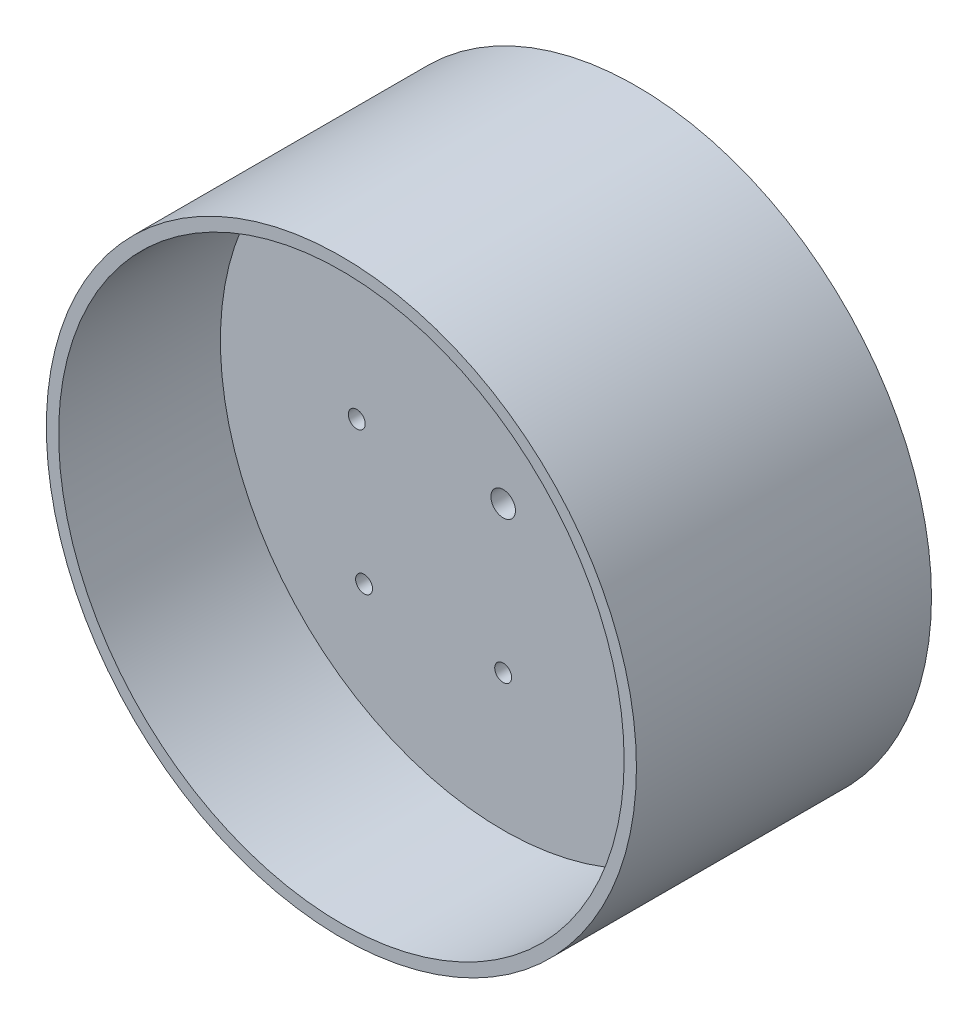
ISO-10303-21;
HEADER;
FILE_DESCRIPTION(('STEP AP214'),'2;1');
FILE_NAME('part.step','',(''),(''),'','','');
FILE_SCHEMA(('AUTOMOTIVE_DESIGN { 1 0 10303 214 1 1 1 1 }'));
ENDSEC;
DATA;
#1=APPLICATION_CONTEXT('core data for automotive mechanical design processes');
#2=APPLICATION_PROTOCOL_DEFINITION('international standard','automotive_design',2000,#1);
#3=PRODUCT_CONTEXT('',#1,'mechanical');
#4=PRODUCT('Part','Part','',(#3));
#5=PRODUCT_RELATED_PRODUCT_CATEGORY('part','',(#4));
#6=PRODUCT_DEFINITION_FORMATION('','',#4);
#7=PRODUCT_DEFINITION_CONTEXT('part definition',#1,'design');
#8=PRODUCT_DEFINITION('design','',#6,#7);
#9=PRODUCT_DEFINITION_SHAPE('','',#8);
#10=(LENGTH_UNIT() NAMED_UNIT(*) SI_UNIT(.MILLI.,.METRE.));
#11=(NAMED_UNIT(*) PLANE_ANGLE_UNIT() SI_UNIT($,.RADIAN.));
#12=(NAMED_UNIT(*) SI_UNIT($,.STERADIAN.) SOLID_ANGLE_UNIT());
#13=UNCERTAINTY_MEASURE_WITH_UNIT(LENGTH_MEASURE(1.E-05),#10,'distance_accuracy_value','');
#14=(GEOMETRIC_REPRESENTATION_CONTEXT(3) GLOBAL_UNCERTAINTY_ASSIGNED_CONTEXT((#13)) GLOBAL_UNIT_ASSIGNED_CONTEXT((#10,
#11,#12)) REPRESENTATION_CONTEXT('',''));
#15=CARTESIAN_POINT('',(0.,0.,0.));
#16=DIRECTION('',(0.,0.,1.));
#17=DIRECTION('',(1.,0.,0.));
#18=AXIS2_PLACEMENT_3D('',#15,#16,#17);
#19=CARTESIAN_POINT('',(0.,0.,76.2));
#20=DIRECTION('',(0.,0.,1.));
#21=DIRECTION('',(1.,0.,0.));
#22=AXIS2_PLACEMENT_3D('',#19,#20,#21);
#23=PLANE('',#22);
#24=CARTESIAN_POINT('',(0.,0.,76.2));
#25=DIRECTION('',(0.,0.,1.));
#26=DIRECTION('',(1.,0.,0.));
#27=AXIS2_PLACEMENT_3D('',#24,#25,#26);
#28=CIRCLE('',#27,76.2);
#29=CARTESIAN_POINT('',(76.2,0.,76.2));
#30=VERTEX_POINT('',#29);
#31=EDGE_CURVE('E51',#30,#30,#28,.T.);
#32=ORIENTED_EDGE('',*,*,#31,.T.);
#33=EDGE_LOOP('',(#32));
#34=FACE_BOUND('',#33,.T.);
#35=CARTESIAN_POINT('',(0.,0.,76.2));
#36=DIRECTION('',(0.,0.,1.));
#37=DIRECTION('',(1.,0.,0.));
#38=AXIS2_PLACEMENT_3D('',#35,#36,#37);
#39=CIRCLE('',#38,73.025);
#40=CARTESIAN_POINT('',(73.025,0.,76.2));
#41=VERTEX_POINT('',#40);
#42=EDGE_CURVE('E66',#41,#41,#39,.T.);
#43=ORIENTED_EDGE('',*,*,#42,.F.);
#44=EDGE_LOOP('',(#43));
#45=FACE_BOUND('',#44,.T.);
#46=ADVANCED_FACE('F43',(#34,#45),#23,.T.);
#47=CARTESIAN_POINT('',(0.,0.,0.));
#48=DIRECTION('',(0.,0.,1.));
#49=DIRECTION('',(1.,0.,0.));
#50=AXIS2_PLACEMENT_3D('',#47,#48,#49);
#51=PLANE('',#50);
#52=CARTESIAN_POINT('',(0.,0.,0.));
#53=DIRECTION('',(0.,0.,1.));
#54=DIRECTION('',(1.,0.,0.));
#55=AXIS2_PLACEMENT_3D('',#52,#53,#54);
#56=CIRCLE('',#55,3.175);
#57=CARTESIAN_POINT('',(3.175,0.,0.));
#58=VERTEX_POINT('',#57);
#59=EDGE_CURVE('E117',#58,#58,#56,.T.);
#60=ORIENTED_EDGE('',*,*,#59,.T.);
#61=EDGE_LOOP('',(#60));
#62=FACE_BOUND('',#61,.T.);
#63=CARTESIAN_POINT('',(35.9210244842765,35.9210244842768,0.));
#64=DIRECTION('',(0.,0.,1.));
#65=DIRECTION('',(1.,0.,0.));
#66=AXIS2_PLACEMENT_3D('',#63,#64,#65);
#67=CIRCLE('',#66,2.1828125);
#68=CARTESIAN_POINT('',(38.1038369842765,35.9210244842768,0.));
#69=VERTEX_POINT('',#68);
#70=EDGE_CURVE('E112',#69,#69,#67,.T.);
#71=ORIENTED_EDGE('',*,*,#70,.T.);
#72=EDGE_LOOP('',(#71));
#73=FACE_BOUND('',#72,.T.);
#74=CARTESIAN_POINT('',(35.9210244842767,-35.9210244842765,0.));
#75=DIRECTION('',(0.,0.,1.));
#76=DIRECTION('',(1.,0.,0.));
#77=AXIS2_PLACEMENT_3D('',#74,#75,#76);
#78=CIRCLE('',#77,2.18281250000001);
#79=CARTESIAN_POINT('',(38.1038369842767,-35.9210244842765,0.));
#80=VERTEX_POINT('',#79);
#81=EDGE_CURVE('E121',#80,#80,#78,.T.);
#82=ORIENTED_EDGE('',*,*,#81,.T.);
#83=EDGE_LOOP('',(#82));
#84=FACE_BOUND('',#83,.T.);
#85=CARTESIAN_POINT('',(-35.9210244842765,-35.9210244842768,0.));
#86=DIRECTION('',(0.,0.,1.));
#87=DIRECTION('',(1.,0.,0.));
#88=AXIS2_PLACEMENT_3D('',#85,#86,#87);
#89=CIRCLE('',#88,2.18281250000001);
#90=CARTESIAN_POINT('',(-33.7382119842765,-35.9210244842768,0.));
#91=VERTEX_POINT('',#90);
#92=EDGE_CURVE('E129',#91,#91,#89,.T.);
#93=ORIENTED_EDGE('',*,*,#92,.T.);
#94=EDGE_LOOP('',(#93));
#95=FACE_BOUND('',#94,.T.);
#96=CARTESIAN_POINT('',(-35.9210244842768,35.9210244842765,0.));
#97=DIRECTION('',(0.,0.,1.));
#98=DIRECTION('',(1.,0.,0.));
#99=AXIS2_PLACEMENT_3D('',#96,#97,#98);
#100=CIRCLE('',#99,2.18281250000001);
#101=CARTESIAN_POINT('',(-33.7382119842768,35.9210244842765,0.));
#102=VERTEX_POINT('',#101);
#103=EDGE_CURVE('E77',#102,#102,#100,.T.);
#104=ORIENTED_EDGE('',*,*,#103,.T.);
#105=EDGE_LOOP('',(#104));
#106=FACE_BOUND('',#105,.T.);
#107=CARTESIAN_POINT('',(37.81298,0.,0.));
#108=DIRECTION('',(0.,0.,1.));
#109=DIRECTION('',(1.,0.,0.));
#110=AXIS2_PLACEMENT_3D('',#107,#108,#109);
#111=CIRCLE('',#110,2.1828125);
#112=CARTESIAN_POINT('',(39.9957925,0.,0.));
#113=VERTEX_POINT('',#112);
#114=EDGE_CURVE('E71',#113,#113,#111,.T.);
#115=ORIENTED_EDGE('',*,*,#114,.T.);
#116=EDGE_LOOP('',(#115));
#117=FACE_BOUND('',#116,.T.);
#118=CARTESIAN_POINT('',(0.,37.81298,0.));
#119=DIRECTION('',(0.,0.,1.));
#120=DIRECTION('',(1.,0.,0.));
#121=AXIS2_PLACEMENT_3D('',#118,#119,#120);
#122=CIRCLE('',#121,2.1828125);
#123=CARTESIAN_POINT('',(2.1828125,37.81298,0.));
#124=VERTEX_POINT('',#123);
#125=EDGE_CURVE('E89',#124,#124,#122,.T.);
#126=ORIENTED_EDGE('',*,*,#125,.T.);
#127=EDGE_LOOP('',(#126));
#128=FACE_BOUND('',#127,.T.);
#129=CARTESIAN_POINT('',(-37.81298,0.,0.));
#130=DIRECTION('',(0.,0.,1.));
#131=DIRECTION('',(1.,0.,0.));
#132=AXIS2_PLACEMENT_3D('',#129,#130,#131);
#133=CIRCLE('',#132,2.1828125);
#134=CARTESIAN_POINT('',(-35.6301675,0.,0.));
#135=VERTEX_POINT('',#134);
#136=EDGE_CURVE('E81',#135,#135,#133,.T.);
#137=ORIENTED_EDGE('',*,*,#136,.T.);
#138=EDGE_LOOP('',(#137));
#139=FACE_BOUND('',#138,.T.);
#140=CARTESIAN_POINT('',(0.,-37.81298,0.));
#141=DIRECTION('',(0.,0.,1.));
#142=DIRECTION('',(1.,0.,0.));
#143=AXIS2_PLACEMENT_3D('',#140,#141,#142);
#144=CIRCLE('',#143,2.1828125);
#145=CARTESIAN_POINT('',(2.1828125,-37.81298,0.));
#146=VERTEX_POINT('',#145);
#147=EDGE_CURVE('E72',#146,#146,#144,.T.);
#148=ORIENTED_EDGE('',*,*,#147,.T.);
#149=EDGE_LOOP('',(#148));
#150=FACE_BOUND('',#149,.T.);
#151=CARTESIAN_POINT('',(0.,0.,0.));
#152=DIRECTION('',(0.,0.,1.));
#153=DIRECTION('',(1.,0.,0.));
#154=AXIS2_PLACEMENT_3D('',#151,#152,#153);
#155=CIRCLE('',#154,76.2);
#156=CARTESIAN_POINT('',(76.2,0.,0.));
#157=VERTEX_POINT('',#156);
#158=EDGE_CURVE('E58',#157,#157,#155,.T.);
#159=ORIENTED_EDGE('',*,*,#158,.F.);
#160=EDGE_LOOP('',(#159));
#161=FACE_BOUND('',#160,.T.);
#162=ADVANCED_FACE('F146',(#62,#73,#84,#95,#106,#117,#128,#139,#150,#161),#51,.F.);
#163=CARTESIAN_POINT('',(0.,0.,76.2));
#164=DIRECTION('',(0.,0.,-1.));
#165=DIRECTION('',(-1.,0.,0.));
#166=AXIS2_PLACEMENT_3D('',#163,#164,#165);
#167=CYLINDRICAL_SURFACE('',#166,76.2);
#168=ORIENTED_EDGE('',*,*,#31,.F.);
#169=EDGE_LOOP('',(#168));
#170=FACE_BOUND('',#169,.T.);
#171=ORIENTED_EDGE('',*,*,#158,.T.);
#172=EDGE_LOOP('',(#171));
#173=FACE_BOUND('',#172,.T.);
#174=ADVANCED_FACE('F45',(#170,#173),#167,.T.);
#175=CARTESIAN_POINT('',(0.,0.,76.2));
#176=DIRECTION('',(0.,0.,-1.));
#177=DIRECTION('',(-1.,0.,0.));
#178=AXIS2_PLACEMENT_3D('',#175,#176,#177);
#179=CYLINDRICAL_SURFACE('',#178,73.025);
#180=CARTESIAN_POINT('',(0.,0.,34.417));
#181=DIRECTION('',(0.,0.,1.));
#182=DIRECTION('',(1.,0.,0.));
#183=AXIS2_PLACEMENT_3D('',#180,#181,#182);
#184=CIRCLE('',#183,73.025);
#185=CARTESIAN_POINT('',(73.025,0.,34.417));
#186=VERTEX_POINT('',#185);
#187=EDGE_CURVE('E10',#186,#186,#184,.T.);
#188=ORIENTED_EDGE('',*,*,#187,.F.);
#189=EDGE_LOOP('',(#188));
#190=FACE_BOUND('',#189,.T.);
#191=ORIENTED_EDGE('',*,*,#42,.T.);
#192=EDGE_LOOP('',(#191));
#193=FACE_BOUND('',#192,.T.);
#194=ADVANCED_FACE('F160',(#190,#193),#179,.F.);
#195=CARTESIAN_POINT('',(0.,0.,34.417));
#196=DIRECTION('',(0.,0.,1.));
#197=DIRECTION('',(1.,0.,0.));
#198=AXIS2_PLACEMENT_3D('',#195,#196,#197);
#199=PLANE('',#198);
#200=CARTESIAN_POINT('',(0.,0.,34.417));
#201=DIRECTION('',(0.,0.,1.));
#202=DIRECTION('',(1.,0.,0.));
#203=AXIS2_PLACEMENT_3D('',#200,#201,#202);
#204=CIRCLE('',#203,3.175);
#205=CARTESIAN_POINT('',(3.175,0.,34.417));
#206=VERTEX_POINT('',#205);
#207=EDGE_CURVE('E136',#206,#206,#204,.T.);
#208=ORIENTED_EDGE('',*,*,#207,.F.);
#209=EDGE_LOOP('',(#208));
#210=FACE_BOUND('',#209,.T.);
#211=CARTESIAN_POINT('',(35.9210244842765,35.9210244842768,34.417));
#212=DIRECTION('',(0.,0.,1.));
#213=DIRECTION('',(1.,0.,0.));
#214=AXIS2_PLACEMENT_3D('',#211,#212,#213);
#215=CIRCLE('',#214,2.1828125);
#216=CARTESIAN_POINT('',(38.1038369842765,35.9210244842768,34.417));
#217=VERTEX_POINT('',#216);
#218=EDGE_CURVE('E116',#217,#217,#215,.T.);
#219=ORIENTED_EDGE('',*,*,#218,.F.);
#220=EDGE_LOOP('',(#219));
#221=FACE_BOUND('',#220,.T.);
#222=CARTESIAN_POINT('',(35.9210244842767,-35.9210244842765,34.417));
#223=DIRECTION('',(0.,0.,1.));
#224=DIRECTION('',(1.,0.,0.));
#225=AXIS2_PLACEMENT_3D('',#222,#223,#224);
#226=CIRCLE('',#225,2.18281250000001);
#227=CARTESIAN_POINT('',(38.1038369842767,-35.9210244842765,34.417));
#228=VERTEX_POINT('',#227);
#229=EDGE_CURVE('E125',#228,#228,#226,.T.);
#230=ORIENTED_EDGE('',*,*,#229,.F.);
#231=EDGE_LOOP('',(#230));
#232=FACE_BOUND('',#231,.T.);
#233=CARTESIAN_POINT('',(-35.9210244842765,-35.9210244842768,34.417));
#234=DIRECTION('',(0.,0.,1.));
#235=DIRECTION('',(1.,0.,0.));
#236=AXIS2_PLACEMENT_3D('',#233,#234,#235);
#237=CIRCLE('',#236,2.18281250000001);
#238=CARTESIAN_POINT('',(-33.7382119842765,-35.9210244842768,34.417));
#239=VERTEX_POINT('',#238);
#240=EDGE_CURVE('E108',#239,#239,#237,.T.);
#241=ORIENTED_EDGE('',*,*,#240,.F.);
#242=EDGE_LOOP('',(#241));
#243=FACE_BOUND('',#242,.T.);
#244=CARTESIAN_POINT('',(-35.9210244842768,35.9210244842765,34.417));
#245=DIRECTION('',(0.,0.,1.));
#246=DIRECTION('',(1.,0.,0.));
#247=AXIS2_PLACEMENT_3D('',#244,#245,#246);
#248=CIRCLE('',#247,2.18281250000001);
#249=CARTESIAN_POINT('',(-33.7382119842768,35.9210244842765,34.417));
#250=VERTEX_POINT('',#249);
#251=EDGE_CURVE('E104',#250,#250,#248,.T.);
#252=ORIENTED_EDGE('',*,*,#251,.F.);
#253=EDGE_LOOP('',(#252));
#254=FACE_BOUND('',#253,.T.);
#255=CARTESIAN_POINT('',(37.81298,0.,34.417));
#256=DIRECTION('',(0.,0.,1.));
#257=DIRECTION('',(1.,0.,0.));
#258=AXIS2_PLACEMENT_3D('',#255,#256,#257);
#259=CIRCLE('',#258,2.1828125);
#260=CARTESIAN_POINT('',(39.9957925,0.,34.417));
#261=VERTEX_POINT('',#260);
#262=EDGE_CURVE('E97',#261,#261,#259,.T.);
#263=ORIENTED_EDGE('',*,*,#262,.F.);
#264=EDGE_LOOP('',(#263));
#265=FACE_BOUND('',#264,.T.);
#266=CARTESIAN_POINT('',(0.,37.81298,34.417));
#267=DIRECTION('',(0.,0.,1.));
#268=DIRECTION('',(1.,0.,0.));
#269=AXIS2_PLACEMENT_3D('',#266,#267,#268);
#270=CIRCLE('',#269,2.1828125);
#271=CARTESIAN_POINT('',(2.1828125,37.81298,34.417));
#272=VERTEX_POINT('',#271);
#273=EDGE_CURVE('E93',#272,#272,#270,.T.);
#274=ORIENTED_EDGE('',*,*,#273,.F.);
#275=EDGE_LOOP('',(#274));
#276=FACE_BOUND('',#275,.T.);
#277=CARTESIAN_POINT('',(-37.81298,0.,34.417));
#278=DIRECTION('',(0.,0.,1.));
#279=DIRECTION('',(1.,0.,0.));
#280=AXIS2_PLACEMENT_3D('',#277,#278,#279);
#281=CIRCLE('',#280,2.1828125);
#282=CARTESIAN_POINT('',(-35.6301675,0.,34.417));
#283=VERTEX_POINT('',#282);
#284=EDGE_CURVE('E85',#283,#283,#281,.T.);
#285=ORIENTED_EDGE('',*,*,#284,.F.);
#286=EDGE_LOOP('',(#285));
#287=FACE_BOUND('',#286,.T.);
#288=CARTESIAN_POINT('',(0.,-37.81298,34.417));
#289=DIRECTION('',(0.,0.,1.));
#290=DIRECTION('',(1.,0.,0.));
#291=AXIS2_PLACEMENT_3D('',#288,#289,#290);
#292=CIRCLE('',#291,2.1828125);
#293=CARTESIAN_POINT('',(2.1828125,-37.81298,34.417));
#294=VERTEX_POINT('',#293);
#295=EDGE_CURVE('E76',#294,#294,#292,.T.);
#296=ORIENTED_EDGE('',*,*,#295,.F.);
#297=EDGE_LOOP('',(#296));
#298=FACE_BOUND('',#297,.T.);
#299=ORIENTED_EDGE('',*,*,#187,.T.);
#300=EDGE_LOOP('',(#299));
#301=FACE_BOUND('',#300,.T.);
#302=ADVANCED_FACE('F156',(#210,#221,#232,#243,#254,#265,#276,#287,#298,#301),#199,.T.);
#303=CARTESIAN_POINT('',(0.,-37.81298,0.));
#304=DIRECTION('',(0.,0.,1.));
#305=DIRECTION('',(1.,0.,0.));
#306=AXIS2_PLACEMENT_3D('',#303,#304,#305);
#307=CYLINDRICAL_SURFACE('',#306,2.1828125);
#308=ORIENTED_EDGE('',*,*,#147,.F.);
#309=EDGE_LOOP('',(#308));
#310=FACE_BOUND('',#309,.T.);
#311=ORIENTED_EDGE('',*,*,#295,.T.);
#312=EDGE_LOOP('',(#311));
#313=FACE_BOUND('',#312,.T.);
#314=ADVANCED_FACE('F159',(#310,#313),#307,.F.);
#315=CARTESIAN_POINT('',(-37.81298,0.,0.));
#316=DIRECTION('',(0.,0.,1.));
#317=DIRECTION('',(1.,0.,0.));
#318=AXIS2_PLACEMENT_3D('',#315,#316,#317);
#319=CYLINDRICAL_SURFACE('',#318,2.1828125);
#320=ORIENTED_EDGE('',*,*,#136,.F.);
#321=EDGE_LOOP('',(#320));
#322=FACE_BOUND('',#321,.T.);
#323=ORIENTED_EDGE('',*,*,#284,.T.);
#324=EDGE_LOOP('',(#323));
#325=FACE_BOUND('',#324,.T.);
#326=ADVANCED_FACE('F179',(#322,#325),#319,.F.);
#327=CARTESIAN_POINT('',(0.,37.81298,0.));
#328=DIRECTION('',(0.,0.,1.));
#329=DIRECTION('',(1.,0.,0.));
#330=AXIS2_PLACEMENT_3D('',#327,#328,#329);
#331=CYLINDRICAL_SURFACE('',#330,2.1828125);
#332=ORIENTED_EDGE('',*,*,#125,.F.);
#333=EDGE_LOOP('',(#332));
#334=FACE_BOUND('',#333,.T.);
#335=ORIENTED_EDGE('',*,*,#273,.T.);
#336=EDGE_LOOP('',(#335));
#337=FACE_BOUND('',#336,.T.);
#338=ADVANCED_FACE('F185',(#334,#337),#331,.F.);
#339=CARTESIAN_POINT('',(37.81298,0.,0.));
#340=DIRECTION('',(0.,0.,1.));
#341=DIRECTION('',(1.,0.,0.));
#342=AXIS2_PLACEMENT_3D('',#339,#340,#341);
#343=CYLINDRICAL_SURFACE('',#342,2.1828125);
#344=ORIENTED_EDGE('',*,*,#114,.F.);
#345=EDGE_LOOP('',(#344));
#346=FACE_BOUND('',#345,.T.);
#347=ORIENTED_EDGE('',*,*,#262,.T.);
#348=EDGE_LOOP('',(#347));
#349=FACE_BOUND('',#348,.T.);
#350=ADVANCED_FACE('F262',(#346,#349),#343,.F.);
#351=CARTESIAN_POINT('',(-35.9210244842768,35.9210244842765,0.));
#352=DIRECTION('',(0.,0.,1.));
#353=DIRECTION('',(1.,0.,0.));
#354=AXIS2_PLACEMENT_3D('',#351,#352,#353);
#355=CYLINDRICAL_SURFACE('',#354,2.18281250000001);
#356=ORIENTED_EDGE('',*,*,#103,.F.);
#357=EDGE_LOOP('',(#356));
#358=FACE_BOUND('',#357,.T.);
#359=ORIENTED_EDGE('',*,*,#251,.T.);
#360=EDGE_LOOP('',(#359));
#361=FACE_BOUND('',#360,.T.);
#362=ADVANCED_FACE('F254',(#358,#361),#355,.F.);
#363=CARTESIAN_POINT('',(-35.9210244842765,-35.9210244842768,0.));
#364=DIRECTION('',(0.,0.,1.));
#365=DIRECTION('',(1.,0.,0.));
#366=AXIS2_PLACEMENT_3D('',#363,#364,#365);
#367=CYLINDRICAL_SURFACE('',#366,2.18281250000001);
#368=ORIENTED_EDGE('',*,*,#92,.F.);
#369=EDGE_LOOP('',(#368));
#370=FACE_BOUND('',#369,.T.);
#371=ORIENTED_EDGE('',*,*,#240,.T.);
#372=EDGE_LOOP('',(#371));
#373=FACE_BOUND('',#372,.T.);
#374=ADVANCED_FACE('F246',(#370,#373),#367,.F.);
#375=CARTESIAN_POINT('',(35.9210244842767,-35.9210244842765,0.));
#376=DIRECTION('',(0.,0.,1.));
#377=DIRECTION('',(1.,0.,0.));
#378=AXIS2_PLACEMENT_3D('',#375,#376,#377);
#379=CYLINDRICAL_SURFACE('',#378,2.18281250000001);
#380=ORIENTED_EDGE('',*,*,#81,.F.);
#381=EDGE_LOOP('',(#380));
#382=FACE_BOUND('',#381,.T.);
#383=ORIENTED_EDGE('',*,*,#229,.T.);
#384=EDGE_LOOP('',(#383));
#385=FACE_BOUND('',#384,.T.);
#386=ADVANCED_FACE('F241',(#382,#385),#379,.F.);
#387=CARTESIAN_POINT('',(35.9210244842765,35.9210244842768,0.));
#388=DIRECTION('',(0.,0.,1.));
#389=DIRECTION('',(1.,0.,0.));
#390=AXIS2_PLACEMENT_3D('',#387,#388,#389);
#391=CYLINDRICAL_SURFACE('',#390,2.1828125);
#392=ORIENTED_EDGE('',*,*,#70,.F.);
#393=EDGE_LOOP('',(#392));
#394=FACE_BOUND('',#393,.T.);
#395=ORIENTED_EDGE('',*,*,#218,.T.);
#396=EDGE_LOOP('',(#395));
#397=FACE_BOUND('',#396,.T.);
#398=ADVANCED_FACE('F152',(#394,#397),#391,.F.);
#399=CARTESIAN_POINT('',(0.,0.,0.));
#400=DIRECTION('',(0.,0.,1.));
#401=DIRECTION('',(1.,0.,0.));
#402=AXIS2_PLACEMENT_3D('',#399,#400,#401);
#403=CYLINDRICAL_SURFACE('',#402,3.175);
#404=ORIENTED_EDGE('',*,*,#59,.F.);
#405=EDGE_LOOP('',(#404));
#406=FACE_BOUND('',#405,.T.);
#407=ORIENTED_EDGE('',*,*,#207,.T.);
#408=EDGE_LOOP('',(#407));
#409=FACE_BOUND('',#408,.T.);
#410=ADVANCED_FACE('F149',(#406,#409),#403,.F.);
#411=CLOSED_SHELL('',(#46,#162,#174,#194,#302,#314,#326,#338,#350,#362,#374,#386,#398,#410));
#412=MANIFOLD_SOLID_BREP('B2',#411);
#413=ADVANCED_BREP_SHAPE_REPRESENTATION('',(#18,#412),#14);
#414=SHAPE_DEFINITION_REPRESENTATION(#9,#413);
ENDSEC;
END-ISO-10303-21;
